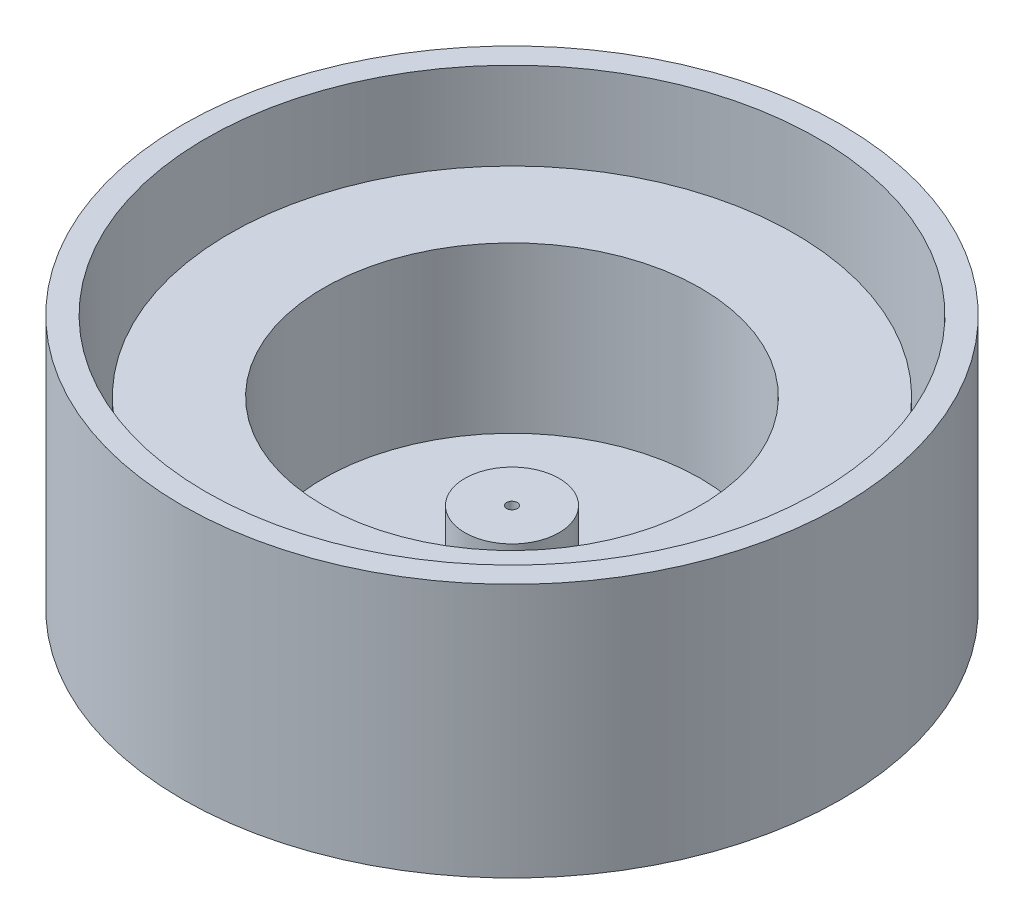
ISO-10303-21;
HEADER;
FILE_DESCRIPTION(('STEP AP214'),'2;1');
FILE_NAME('part.step','',(''),(''),'','','');
FILE_SCHEMA(('AUTOMOTIVE_DESIGN { 1 0 10303 214 1 1 1 1 }'));
ENDSEC;
DATA;
#1=APPLICATION_CONTEXT('core data for automotive mechanical design processes');
#2=APPLICATION_PROTOCOL_DEFINITION('international standard','automotive_design',2000,#1);
#3=PRODUCT_CONTEXT('',#1,'mechanical');
#4=PRODUCT('Part','Part','',(#3));
#5=PRODUCT_RELATED_PRODUCT_CATEGORY('part','',(#4));
#6=PRODUCT_DEFINITION_FORMATION('','',#4);
#7=PRODUCT_DEFINITION_CONTEXT('part definition',#1,'design');
#8=PRODUCT_DEFINITION('design','',#6,#7);
#9=PRODUCT_DEFINITION_SHAPE('','',#8);
#10=(LENGTH_UNIT() NAMED_UNIT(*) SI_UNIT(.MILLI.,.METRE.));
#11=(NAMED_UNIT(*) PLANE_ANGLE_UNIT() SI_UNIT($,.RADIAN.));
#12=(NAMED_UNIT(*) SI_UNIT($,.STERADIAN.) SOLID_ANGLE_UNIT());
#13=UNCERTAINTY_MEASURE_WITH_UNIT(LENGTH_MEASURE(1.E-05),#10,'distance_accuracy_value','');
#14=(GEOMETRIC_REPRESENTATION_CONTEXT(3) GLOBAL_UNCERTAINTY_ASSIGNED_CONTEXT((#13)) GLOBAL_UNIT_ASSIGNED_CONTEXT((#10,
#11,#12)) REPRESENTATION_CONTEXT('',''));
#15=CARTESIAN_POINT('',(0.,0.,0.));
#16=DIRECTION('',(0.,0.,1.));
#17=DIRECTION('',(1.,0.,0.));
#18=AXIS2_PLACEMENT_3D('',#15,#16,#17);
#19=CARTESIAN_POINT('',(0.,0.,0.));
#20=DIRECTION('',(0.,1.,0.));
#21=DIRECTION('',(0.,0.,1.));
#22=AXIS2_PLACEMENT_3D('',#19,#20,#21);
#23=PLANE('',#22);
#24=CARTESIAN_POINT('',(0.,0.,0.));
#25=DIRECTION('',(0.,1.,0.));
#26=DIRECTION('',(0.,0.,1.));
#27=AXIS2_PLACEMENT_3D('',#24,#25,#26);
#28=CIRCLE('',#27,10.);
#29=CARTESIAN_POINT('',(0.,0.,10.));
#30=VERTEX_POINT('',#29);
#31=EDGE_CURVE('E52',#30,#30,#28,.T.);
#32=ORIENTED_EDGE('',*,*,#31,.F.);
#33=EDGE_LOOP('',(#32));
#34=FACE_BOUND('',#33,.T.);
#35=CARTESIAN_POINT('',(0.,0.,0.));
#36=DIRECTION('',(0.,1.,0.));
#37=DIRECTION('',(0.,0.,1.));
#38=AXIS2_PLACEMENT_3D('',#35,#36,#37);
#39=CIRCLE('',#38,40.);
#40=CARTESIAN_POINT('',(0.,0.,40.));
#41=VERTEX_POINT('',#40);
#42=EDGE_CURVE('E10',#41,#41,#39,.F.);
#43=ORIENTED_EDGE('',*,*,#42,.F.);
#44=EDGE_LOOP('',(#43));
#45=FACE_BOUND('',#44,.T.);
#46=ADVANCED_FACE('F31',(#34,#45),#23,.T.);
#47=CARTESIAN_POINT('',(0.,15.,0.));
#48=DIRECTION('',(0.,-1.,0.));
#49=DIRECTION('',(0.,0.,-1.));
#50=AXIS2_PLACEMENT_3D('',#47,#48,#49);
#51=CYLINDRICAL_SURFACE('',#50,1.125);
#52=CARTESIAN_POINT('',(0.,15.,0.));
#53=DIRECTION('',(0.,1.,0.));
#54=DIRECTION('',(0.,0.,1.));
#55=AXIS2_PLACEMENT_3D('',#52,#53,#54);
#56=CIRCLE('',#55,1.125);
#57=CARTESIAN_POINT('',(0.,15.,1.125));
#58=VERTEX_POINT('',#57);
#59=EDGE_CURVE('E55',#58,#58,#56,.T.);
#60=ORIENTED_EDGE('',*,*,#59,.T.);
#61=EDGE_LOOP('',(#60));
#62=FACE_BOUND('',#61,.T.);
#63=CARTESIAN_POINT('',(0.,0.,0.));
#64=DIRECTION('',(0.,1.,0.));
#65=DIRECTION('',(0.,0.,1.));
#66=AXIS2_PLACEMENT_3D('',#63,#64,#65);
#67=CIRCLE('',#66,1.125);
#68=CARTESIAN_POINT('',(0.,0.,1.125));
#69=VERTEX_POINT('',#68);
#70=EDGE_CURVE('E42',#69,#69,#67,.F.);
#71=ORIENTED_EDGE('',*,*,#70,.T.);
#72=EDGE_LOOP('',(#71));
#73=FACE_BOUND('',#72,.T.);
#74=ADVANCED_FACE('F104',(#62,#73),#51,.F.);
#75=CARTESIAN_POINT('',(0.,15.,0.));
#76=DIRECTION('',(0.,-1.,0.));
#77=DIRECTION('',(0.,0.,-1.));
#78=AXIS2_PLACEMENT_3D('',#75,#76,#77);
#79=CYLINDRICAL_SURFACE('',#78,10.);
#80=CARTESIAN_POINT('',(0.,15.,0.));
#81=DIRECTION('',(0.,1.,0.));
#82=DIRECTION('',(0.,0.,1.));
#83=AXIS2_PLACEMENT_3D('',#80,#81,#82);
#84=CIRCLE('',#83,10.);
#85=CARTESIAN_POINT('',(0.,15.,10.));
#86=VERTEX_POINT('',#85);
#87=EDGE_CURVE('E51',#86,#86,#84,.T.);
#88=ORIENTED_EDGE('',*,*,#87,.F.);
#89=EDGE_LOOP('',(#88));
#90=FACE_BOUND('',#89,.T.);
#91=ORIENTED_EDGE('',*,*,#31,.T.);
#92=EDGE_LOOP('',(#91));
#93=FACE_BOUND('',#92,.T.);
#94=ADVANCED_FACE('F114',(#90,#93),#79,.T.);
#95=CARTESIAN_POINT('',(0.,15.,0.));
#96=DIRECTION('',(0.,1.,0.));
#97=DIRECTION('',(0.,0.,1.));
#98=AXIS2_PLACEMENT_3D('',#95,#96,#97);
#99=PLANE('',#98);
#100=ORIENTED_EDGE('',*,*,#59,.F.);
#101=EDGE_LOOP('',(#100));
#102=FACE_BOUND('',#101,.T.);
#103=ORIENTED_EDGE('',*,*,#87,.T.);
#104=EDGE_LOOP('',(#103));
#105=FACE_BOUND('',#104,.T.);
#106=ADVANCED_FACE('F107',(#102,#105),#99,.T.);
#107=ORIENTED_EDGE('',*,*,#70,.F.);
#108=EDGE_LOOP('',(#107));
#109=FACE_BOUND('',#108,.T.);
#110=ADVANCED_FACE('F95',(#109),#23,.T.);
#111=CARTESIAN_POINT('',(0.,35.,0.));
#112=DIRECTION('',(0.,-1.,0.));
#113=DIRECTION('',(0.,0.,-1.));
#114=AXIS2_PLACEMENT_3D('',#111,#112,#113);
#115=CYLINDRICAL_SURFACE('',#114,40.);
#116=CARTESIAN_POINT('',(0.,35.,0.));
#117=DIRECTION('',(0.,1.,0.));
#118=DIRECTION('',(0.,0.,1.));
#119=AXIS2_PLACEMENT_3D('',#116,#117,#118);
#120=CIRCLE('',#119,40.);
#121=CARTESIAN_POINT('',(0.,35.,40.));
#122=VERTEX_POINT('',#121);
#123=EDGE_CURVE('E70',#122,#122,#120,.T.);
#124=ORIENTED_EDGE('',*,*,#123,.T.);
#125=EDGE_LOOP('',(#124));
#126=FACE_BOUND('',#125,.T.);
#127=ORIENTED_EDGE('',*,*,#42,.T.);
#128=EDGE_LOOP('',(#127));
#129=FACE_BOUND('',#128,.T.);
#130=ADVANCED_FACE('F76',(#126,#129),#115,.F.);
#131=CARTESIAN_POINT('',(0.,35.,0.));
#132=DIRECTION('',(0.,-1.,0.));
#133=DIRECTION('',(0.,0.,-1.));
#134=AXIS2_PLACEMENT_3D('',#131,#132,#133);
#135=CYLINDRICAL_SURFACE('',#134,60.);
#136=CARTESIAN_POINT('',(0.,35.,0.));
#137=DIRECTION('',(0.,1.,0.));
#138=DIRECTION('',(0.,0.,1.));
#139=AXIS2_PLACEMENT_3D('',#136,#137,#138);
#140=CIRCLE('',#139,60.);
#141=CARTESIAN_POINT('',(0.,35.,60.));
#142=VERTEX_POINT('',#141);
#143=EDGE_CURVE('E66',#142,#142,#140,.T.);
#144=ORIENTED_EDGE('',*,*,#143,.F.);
#145=EDGE_LOOP('',(#144));
#146=FACE_BOUND('',#145,.T.);
#147=CARTESIAN_POINT('',(0.,0.,0.));
#148=DIRECTION('',(0.,1.,0.));
#149=DIRECTION('',(0.,0.,1.));
#150=AXIS2_PLACEMENT_3D('',#147,#148,#149);
#151=CIRCLE('',#150,60.);
#152=CARTESIAN_POINT('',(0.,0.,60.));
#153=VERTEX_POINT('',#152);
#154=EDGE_CURVE('E67',#153,#153,#151,.T.);
#155=ORIENTED_EDGE('',*,*,#154,.T.);
#156=EDGE_LOOP('',(#155));
#157=FACE_BOUND('',#156,.T.);
#158=ADVANCED_FACE('F82',(#146,#157),#135,.T.);
#159=CARTESIAN_POINT('',(0.,35.,0.));
#160=DIRECTION('',(0.,1.,0.));
#161=DIRECTION('',(0.,0.,1.));
#162=AXIS2_PLACEMENT_3D('',#159,#160,#161);
#163=PLANE('',#162);
#164=ORIENTED_EDGE('',*,*,#123,.F.);
#165=EDGE_LOOP('',(#164));
#166=FACE_BOUND('',#165,.T.);
#167=ORIENTED_EDGE('',*,*,#143,.T.);
#168=EDGE_LOOP('',(#167));
#169=FACE_BOUND('',#168,.T.);
#170=ADVANCED_FACE('F78',(#166,#169),#163,.T.);
#171=CARTESIAN_POINT('',(0.,-4.,0.));
#172=DIRECTION('',(0.,1.,0.));
#173=DIRECTION('',(0.,0.,1.));
#174=AXIS2_PLACEMENT_3D('',#171,#172,#173);
#175=PLANE('',#174);
#176=CARTESIAN_POINT('',(0.,-4.,0.));
#177=DIRECTION('',(0.,1.,0.));
#178=DIRECTION('',(0.,0.,1.));
#179=AXIS2_PLACEMENT_3D('',#176,#177,#178);
#180=CIRCLE('',#179,70.);
#181=CARTESIAN_POINT('',(0.,-4.,70.));
#182=VERTEX_POINT('',#181);
#183=EDGE_CURVE('E46',#182,#182,#180,.T.);
#184=ORIENTED_EDGE('',*,*,#183,.F.);
#185=EDGE_LOOP('',(#184));
#186=FACE_BOUND('',#185,.T.);
#187=ADVANCED_FACE('F81',(#186),#175,.F.);
#188=CARTESIAN_POINT('',(0.,-4.,0.));
#189=DIRECTION('',(0.,1.,0.));
#190=DIRECTION('',(0.,0.,1.));
#191=AXIS2_PLACEMENT_3D('',#188,#189,#190);
#192=CYLINDRICAL_SURFACE('',#191,70.);
#193=ORIENTED_EDGE('',*,*,#183,.T.);
#194=EDGE_LOOP('',(#193));
#195=FACE_BOUND('',#194,.T.);
#196=CARTESIAN_POINT('',(0.,50.,0.));
#197=DIRECTION('',(0.,1.,0.));
#198=DIRECTION('',(0.,0.,1.));
#199=AXIS2_PLACEMENT_3D('',#196,#197,#198);
#200=CIRCLE('',#199,70.);
#201=CARTESIAN_POINT('',(0.,50.,70.));
#202=VERTEX_POINT('',#201);
#203=EDGE_CURVE('E56',#202,#202,#200,.T.);
#204=ORIENTED_EDGE('',*,*,#203,.F.);
#205=EDGE_LOOP('',(#204));
#206=FACE_BOUND('',#205,.T.);
#207=ADVANCED_FACE('F33',(#195,#206),#192,.T.);
#208=CARTESIAN_POINT('',(0.,50.,0.));
#209=DIRECTION('',(0.,1.,0.));
#210=DIRECTION('',(0.,0.,1.));
#211=AXIS2_PLACEMENT_3D('',#208,#209,#210);
#212=PLANE('',#211);
#213=CARTESIAN_POINT('',(0.,50.,0.));
#214=DIRECTION('',(0.,1.,0.));
#215=DIRECTION('',(0.,0.,1.));
#216=AXIS2_PLACEMENT_3D('',#213,#214,#215);
#217=CIRCLE('',#216,65.);
#218=CARTESIAN_POINT('',(0.,50.,65.));
#219=VERTEX_POINT('',#218);
#220=EDGE_CURVE('E63',#219,#219,#217,.T.);
#221=ORIENTED_EDGE('',*,*,#220,.F.);
#222=EDGE_LOOP('',(#221));
#223=FACE_BOUND('',#222,.T.);
#224=ORIENTED_EDGE('',*,*,#203,.T.);
#225=EDGE_LOOP('',(#224));
#226=FACE_BOUND('',#225,.T.);
#227=ADVANCED_FACE('F99',(#223,#226),#212,.T.);
#228=CARTESIAN_POINT('',(0.,50.,0.));
#229=DIRECTION('',(0.,-1.,0.));
#230=DIRECTION('',(0.,0.,-1.));
#231=AXIS2_PLACEMENT_3D('',#228,#229,#230);
#232=CYLINDRICAL_SURFACE('',#231,65.);
#233=ORIENTED_EDGE('',*,*,#220,.T.);
#234=EDGE_LOOP('',(#233));
#235=FACE_BOUND('',#234,.T.);
#236=CARTESIAN_POINT('',(0.,0.,0.));
#237=DIRECTION('',(0.,1.,0.));
#238=DIRECTION('',(0.,0.,1.));
#239=AXIS2_PLACEMENT_3D('',#236,#237,#238);
#240=CIRCLE('',#239,65.);
#241=CARTESIAN_POINT('',(0.,0.,65.));
#242=VERTEX_POINT('',#241);
#243=EDGE_CURVE('E38',#242,#242,#240,.F.);
#244=ORIENTED_EDGE('',*,*,#243,.T.);
#245=EDGE_LOOP('',(#244));
#246=FACE_BOUND('',#245,.T.);
#247=ADVANCED_FACE('F94',(#235,#246),#232,.F.);
#248=ORIENTED_EDGE('',*,*,#154,.F.);
#249=EDGE_LOOP('',(#248));
#250=FACE_BOUND('',#249,.T.);
#251=ORIENTED_EDGE('',*,*,#243,.F.);
#252=EDGE_LOOP('',(#251));
#253=FACE_BOUND('',#252,.T.);
#254=ADVANCED_FACE('F91',(#250,#253),#23,.T.);
#255=CLOSED_SHELL('',(#46,#74,#94,#106,#110,#130,#158,#170,#187,#207,#227,#247,#254));
#256=MANIFOLD_SOLID_BREP('B2',#255);
#257=ADVANCED_BREP_SHAPE_REPRESENTATION('',(#18,#256),#14);
#258=SHAPE_DEFINITION_REPRESENTATION(#9,#257);
ENDSEC;
END-ISO-10303-21;
